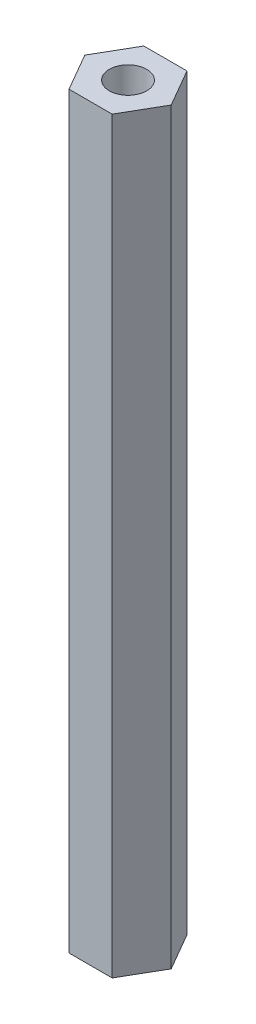
ISO-10303-21;
HEADER;
FILE_DESCRIPTION(('STEP AP214'),'2;1');
FILE_NAME('part.step','',(''),(''),'','','');
FILE_SCHEMA(('AUTOMOTIVE_DESIGN { 1 0 10303 214 1 1 1 1 }'));
ENDSEC;
DATA;
#1=APPLICATION_CONTEXT('core data for automotive mechanical design processes');
#2=APPLICATION_PROTOCOL_DEFINITION('international standard','automotive_design',2000,#1);
#3=PRODUCT_CONTEXT('',#1,'mechanical');
#4=PRODUCT('Part','Part','',(#3));
#5=PRODUCT_RELATED_PRODUCT_CATEGORY('part','',(#4));
#6=PRODUCT_DEFINITION_FORMATION('','',#4);
#7=PRODUCT_DEFINITION_CONTEXT('part definition',#1,'design');
#8=PRODUCT_DEFINITION('design','',#6,#7);
#9=PRODUCT_DEFINITION_SHAPE('','',#8);
#10=(LENGTH_UNIT() NAMED_UNIT(*) SI_UNIT(.MILLI.,.METRE.));
#11=(NAMED_UNIT(*) PLANE_ANGLE_UNIT() SI_UNIT($,.RADIAN.));
#12=(NAMED_UNIT(*) SI_UNIT($,.STERADIAN.) SOLID_ANGLE_UNIT());
#13=UNCERTAINTY_MEASURE_WITH_UNIT(LENGTH_MEASURE(1.E-05),#10,'distance_accuracy_value','');
#14=(GEOMETRIC_REPRESENTATION_CONTEXT(3) GLOBAL_UNCERTAINTY_ASSIGNED_CONTEXT((#13)) GLOBAL_UNIT_ASSIGNED_CONTEXT((#10,
#11,#12)) REPRESENTATION_CONTEXT('',''));
#15=CARTESIAN_POINT('',(0.,0.,0.));
#16=DIRECTION('',(0.,0.,1.));
#17=DIRECTION('',(1.,0.,0.));
#18=AXIS2_PLACEMENT_3D('',#15,#16,#17);
#19=CARTESIAN_POINT('',(0.,63.5,0.));
#20=DIRECTION('',(0.,1.,0.));
#21=DIRECTION('',(0.,0.,1.));
#22=AXIS2_PLACEMENT_3D('',#19,#20,#21);
#23=PLANE('',#22);
#24=DIRECTION('',(1.,0.,0.));
#25=VECTOR('',#24,1.);
#26=CARTESIAN_POINT('',(-3.66617420935412,63.5,6.35));
#27=LINE('',#26,#25);
#28=CARTESIAN_POINT('',(-3.66617420935412,63.5,6.35));
#29=VERTEX_POINT('',#28);
#30=CARTESIAN_POINT('',(3.66617420935413,63.5,6.35));
#31=VERTEX_POINT('',#30);
#32=EDGE_CURVE('E128',#29,#31,#27,.T.);
#33=ORIENTED_EDGE('',*,*,#32,.T.);
#34=DIRECTION('',(0.5,0.,-0.866025403784439));
#35=VECTOR('',#34,1.);
#36=CARTESIAN_POINT('',(3.66617420935413,63.5,6.35));
#37=LINE('',#36,#35);
#38=CARTESIAN_POINT('',(7.33234841870825,63.5,0.));
#39=VERTEX_POINT('',#38);
#40=EDGE_CURVE('E86',#31,#39,#37,.T.);
#41=ORIENTED_EDGE('',*,*,#40,.T.);
#42=DIRECTION('',(-0.500000000000001,0.,-0.866025403784438));
#43=VECTOR('',#42,1.);
#44=CARTESIAN_POINT('',(7.33234841870825,63.5,0.));
#45=LINE('',#44,#43);
#46=CARTESIAN_POINT('',(3.66617420935412,63.5,-6.35));
#47=VERTEX_POINT('',#46);
#48=EDGE_CURVE('E99',#39,#47,#45,.T.);
#49=ORIENTED_EDGE('',*,*,#48,.T.);
#50=DIRECTION('',(-1.,0.,0.));
#51=VECTOR('',#50,1.);
#52=CARTESIAN_POINT('',(3.66617420935412,63.5,-6.35));
#53=LINE('',#52,#51);
#54=CARTESIAN_POINT('',(-3.66617420935413,63.5,-6.35));
#55=VERTEX_POINT('',#54);
#56=EDGE_CURVE('E93',#47,#55,#53,.T.);
#57=ORIENTED_EDGE('',*,*,#56,.T.);
#58=DIRECTION('',(-0.5,0.,0.866025403784439));
#59=VECTOR('',#58,1.);
#60=CARTESIAN_POINT('',(-3.66617420935413,63.5,-6.35));
#61=LINE('',#60,#59);
#62=CARTESIAN_POINT('',(-7.33234841870825,63.5,0.));
#63=VERTEX_POINT('',#62);
#64=EDGE_CURVE('E97',#55,#63,#61,.T.);
#65=ORIENTED_EDGE('',*,*,#64,.T.);
#66=DIRECTION('',(0.5,0.,0.866025403784438));
#67=VECTOR('',#66,1.);
#68=CARTESIAN_POINT('',(-7.33234841870825,63.5,0.));
#69=LINE('',#68,#67);
#70=EDGE_CURVE('E49',#63,#29,#69,.T.);
#71=ORIENTED_EDGE('',*,*,#70,.T.);
#72=EDGE_LOOP('',(#33,#41,#49,#57,#65,#71));
#73=FACE_BOUND('',#72,.T.);
#74=CARTESIAN_POINT('',(0.,63.5,0.));
#75=DIRECTION('',(0.,1.,0.));
#76=DIRECTION('',(0.,0.,1.));
#77=AXIS2_PLACEMENT_3D('',#74,#75,#76);
#78=CIRCLE('',#77,3.175);
#79=CARTESIAN_POINT('',(0.,63.5,3.175));
#80=VERTEX_POINT('',#79);
#81=EDGE_CURVE('E121',#80,#80,#78,.T.);
#82=ORIENTED_EDGE('',*,*,#81,.F.);
#83=EDGE_LOOP('',(#82));
#84=FACE_BOUND('',#83,.T.);
#85=ADVANCED_FACE('F32',(#73,#84),#23,.T.);
#86=CARTESIAN_POINT('',(0.,-63.5,0.));
#87=DIRECTION('',(0.,1.,0.));
#88=DIRECTION('',(0.,0.,1.));
#89=AXIS2_PLACEMENT_3D('',#86,#87,#88);
#90=PLANE('',#89);
#91=DIRECTION('',(1.,0.,0.));
#92=VECTOR('',#91,1.);
#93=CARTESIAN_POINT('',(-3.66617420935412,-63.5,6.35));
#94=LINE('',#93,#92);
#95=CARTESIAN_POINT('',(-3.66617420935412,-63.5,6.35));
#96=VERTEX_POINT('',#95);
#97=CARTESIAN_POINT('',(3.66617420935413,-63.5,6.35));
#98=VERTEX_POINT('',#97);
#99=EDGE_CURVE('E117',#96,#98,#94,.T.);
#100=ORIENTED_EDGE('',*,*,#99,.F.);
#101=DIRECTION('',(0.5,0.,0.866025403784438));
#102=VECTOR('',#101,1.);
#103=CARTESIAN_POINT('',(-7.33234841870825,-63.5,0.));
#104=LINE('',#103,#102);
#105=CARTESIAN_POINT('',(-7.33234841870825,-63.5,0.));
#106=VERTEX_POINT('',#105);
#107=EDGE_CURVE('E78',#106,#96,#104,.T.);
#108=ORIENTED_EDGE('',*,*,#107,.F.);
#109=DIRECTION('',(-0.5,0.,0.866025403784439));
#110=VECTOR('',#109,1.);
#111=CARTESIAN_POINT('',(-3.66617420935413,-63.5,-6.35));
#112=LINE('',#111,#110);
#113=CARTESIAN_POINT('',(-3.66617420935413,-63.5,-6.35));
#114=VERTEX_POINT('',#113);
#115=EDGE_CURVE('E72',#114,#106,#112,.T.);
#116=ORIENTED_EDGE('',*,*,#115,.F.);
#117=DIRECTION('',(-1.,0.,0.));
#118=VECTOR('',#117,1.);
#119=CARTESIAN_POINT('',(3.66617420935412,-63.5,-6.35));
#120=LINE('',#119,#118);
#121=CARTESIAN_POINT('',(3.66617420935412,-63.5,-6.35));
#122=VERTEX_POINT('',#121);
#123=EDGE_CURVE('E107',#122,#114,#120,.T.);
#124=ORIENTED_EDGE('',*,*,#123,.F.);
#125=DIRECTION('',(-0.500000000000001,0.,-0.866025403784438));
#126=VECTOR('',#125,1.);
#127=CARTESIAN_POINT('',(7.33234841870825,-63.5,0.));
#128=LINE('',#127,#126);
#129=CARTESIAN_POINT('',(7.33234841870825,-63.5,0.));
#130=VERTEX_POINT('',#129);
#131=EDGE_CURVE('E123',#130,#122,#128,.T.);
#132=ORIENTED_EDGE('',*,*,#131,.F.);
#133=DIRECTION('',(0.5,0.,-0.866025403784439));
#134=VECTOR('',#133,1.);
#135=CARTESIAN_POINT('',(3.66617420935413,-63.5,6.35));
#136=LINE('',#135,#134);
#137=EDGE_CURVE('E120',#98,#130,#136,.T.);
#138=ORIENTED_EDGE('',*,*,#137,.F.);
#139=EDGE_LOOP('',(#100,#108,#116,#124,#132,#138));
#140=FACE_BOUND('',#139,.T.);
#141=CARTESIAN_POINT('',(0.,-63.5,0.));
#142=DIRECTION('',(0.,1.,0.));
#143=DIRECTION('',(0.,0.,1.));
#144=AXIS2_PLACEMENT_3D('',#141,#142,#143);
#145=CIRCLE('',#144,3.175);
#146=CARTESIAN_POINT('',(0.,-63.5,3.175));
#147=VERTEX_POINT('',#146);
#148=EDGE_CURVE('E221',#147,#147,#145,.T.);
#149=ORIENTED_EDGE('',*,*,#148,.T.);
#150=EDGE_LOOP('',(#149));
#151=FACE_BOUND('',#150,.T.);
#152=ADVANCED_FACE('F137',(#140,#151),#90,.F.);
#153=CARTESIAN_POINT('',(-3.66617420935412,63.5,6.35));
#154=DIRECTION('',(0.,0.,-1.));
#155=DIRECTION('',(-1.,0.,0.));
#156=AXIS2_PLACEMENT_3D('',#153,#154,#155);
#157=PLANE('',#156);
#158=ORIENTED_EDGE('',*,*,#99,.T.);
#159=DIRECTION('',(0.,-1.,0.));
#160=VECTOR('',#159,1.);
#161=CARTESIAN_POINT('',(3.66617420935413,63.5,6.35));
#162=LINE('',#161,#160);
#163=EDGE_CURVE('E11',#31,#98,#162,.T.);
#164=ORIENTED_EDGE('',*,*,#163,.F.);
#165=ORIENTED_EDGE('',*,*,#32,.F.);
#166=DIRECTION('',(0.,-1.,0.));
#167=VECTOR('',#166,1.);
#168=CARTESIAN_POINT('',(-3.66617420935412,63.5,6.35));
#169=LINE('',#168,#167);
#170=EDGE_CURVE('E113',#29,#96,#169,.T.);
#171=ORIENTED_EDGE('',*,*,#170,.T.);
#172=EDGE_LOOP('',(#158,#164,#165,#171));
#173=FACE_BOUND('',#172,.T.);
#174=ADVANCED_FACE('F34',(#173),#157,.F.);
#175=CARTESIAN_POINT('',(3.66617420935413,63.5,6.35));
#176=DIRECTION('',(-0.866025403784439,0.,-0.5));
#177=DIRECTION('',(-0.5,0.,0.866025403784439));
#178=AXIS2_PLACEMENT_3D('',#175,#176,#177);
#179=PLANE('',#178);
#180=ORIENTED_EDGE('',*,*,#137,.T.);
#181=DIRECTION('',(0.,-1.,0.));
#182=VECTOR('',#181,1.);
#183=CARTESIAN_POINT('',(7.33234841870825,63.5,0.));
#184=LINE('',#183,#182);
#185=EDGE_CURVE('E41',#39,#130,#184,.T.);
#186=ORIENTED_EDGE('',*,*,#185,.F.);
#187=ORIENTED_EDGE('',*,*,#40,.F.);
#188=ORIENTED_EDGE('',*,*,#163,.T.);
#189=EDGE_LOOP('',(#180,#186,#187,#188));
#190=FACE_BOUND('',#189,.T.);
#191=ADVANCED_FACE('F162',(#190),#179,.F.);
#192=CARTESIAN_POINT('',(7.33234841870825,63.5,0.));
#193=DIRECTION('',(-0.866025403784438,0.,0.500000000000001));
#194=DIRECTION('',(0.500000000000001,0.,0.866025403784438));
#195=AXIS2_PLACEMENT_3D('',#192,#193,#194);
#196=PLANE('',#195);
#197=ORIENTED_EDGE('',*,*,#131,.T.);
#198=DIRECTION('',(0.,-1.,0.));
#199=VECTOR('',#198,1.);
#200=CARTESIAN_POINT('',(3.66617420935412,63.5,-6.35));
#201=LINE('',#200,#199);
#202=EDGE_CURVE('E108',#47,#122,#201,.T.);
#203=ORIENTED_EDGE('',*,*,#202,.F.);
#204=ORIENTED_EDGE('',*,*,#48,.F.);
#205=ORIENTED_EDGE('',*,*,#185,.T.);
#206=EDGE_LOOP('',(#197,#203,#204,#205));
#207=FACE_BOUND('',#206,.T.);
#208=ADVANCED_FACE('F134',(#207),#196,.F.);
#209=CARTESIAN_POINT('',(3.66617420935412,63.5,-6.35));
#210=DIRECTION('',(0.,0.,1.));
#211=DIRECTION('',(1.,0.,0.));
#212=AXIS2_PLACEMENT_3D('',#209,#210,#211);
#213=PLANE('',#212);
#214=ORIENTED_EDGE('',*,*,#123,.T.);
#215=DIRECTION('',(0.,-1.,0.));
#216=VECTOR('',#215,1.);
#217=CARTESIAN_POINT('',(-3.66617420935413,63.5,-6.35));
#218=LINE('',#217,#216);
#219=EDGE_CURVE('E104',#55,#114,#218,.T.);
#220=ORIENTED_EDGE('',*,*,#219,.F.);
#221=ORIENTED_EDGE('',*,*,#56,.F.);
#222=ORIENTED_EDGE('',*,*,#202,.T.);
#223=EDGE_LOOP('',(#214,#220,#221,#222));
#224=FACE_BOUND('',#223,.T.);
#225=ADVANCED_FACE('F105',(#224),#213,.F.);
#226=CARTESIAN_POINT('',(-3.66617420935413,63.5,-6.35));
#227=DIRECTION('',(0.866025403784439,0.,0.5));
#228=DIRECTION('',(0.5,0.,-0.866025403784439));
#229=AXIS2_PLACEMENT_3D('',#226,#227,#228);
#230=PLANE('',#229);
#231=ORIENTED_EDGE('',*,*,#115,.T.);
#232=DIRECTION('',(0.,-1.,0.));
#233=VECTOR('',#232,1.);
#234=CARTESIAN_POINT('',(-7.33234841870825,63.5,0.));
#235=LINE('',#234,#233);
#236=EDGE_CURVE('E109',#63,#106,#235,.T.);
#237=ORIENTED_EDGE('',*,*,#236,.F.);
#238=ORIENTED_EDGE('',*,*,#64,.F.);
#239=ORIENTED_EDGE('',*,*,#219,.T.);
#240=EDGE_LOOP('',(#231,#237,#238,#239));
#241=FACE_BOUND('',#240,.T.);
#242=ADVANCED_FACE('F111',(#241),#230,.F.);
#243=CARTESIAN_POINT('',(-7.33234841870825,63.5,0.));
#244=DIRECTION('',(0.866025403784438,0.,-0.5));
#245=DIRECTION('',(-0.5,0.,-0.866025403784438));
#246=AXIS2_PLACEMENT_3D('',#243,#244,#245);
#247=PLANE('',#246);
#248=ORIENTED_EDGE('',*,*,#107,.T.);
#249=ORIENTED_EDGE('',*,*,#170,.F.);
#250=ORIENTED_EDGE('',*,*,#70,.F.);
#251=ORIENTED_EDGE('',*,*,#236,.T.);
#252=EDGE_LOOP('',(#248,#249,#250,#251));
#253=FACE_BOUND('',#252,.T.);
#254=ADVANCED_FACE('F142',(#253),#247,.F.);
#255=CARTESIAN_POINT('',(0.,63.5,0.));
#256=DIRECTION('',(0.,-1.,0.));
#257=DIRECTION('',(0.,0.,-1.));
#258=AXIS2_PLACEMENT_3D('',#255,#256,#257);
#259=CYLINDRICAL_SURFACE('',#258,3.175);
#260=ORIENTED_EDGE('',*,*,#81,.T.);
#261=EDGE_LOOP('',(#260));
#262=FACE_BOUND('',#261,.T.);
#263=ORIENTED_EDGE('',*,*,#148,.F.);
#264=EDGE_LOOP('',(#263));
#265=FACE_BOUND('',#264,.T.);
#266=ADVANCED_FACE('F144',(#262,#265),#259,.F.);
#267=CLOSED_SHELL('',(#85,#152,#174,#191,#208,#225,#242,#254,#266));
#268=MANIFOLD_SOLID_BREP('B2',#267);
#269=ADVANCED_BREP_SHAPE_REPRESENTATION('',(#18,#268),#14);
#270=SHAPE_DEFINITION_REPRESENTATION(#9,#269);
ENDSEC;
END-ISO-10303-21;
